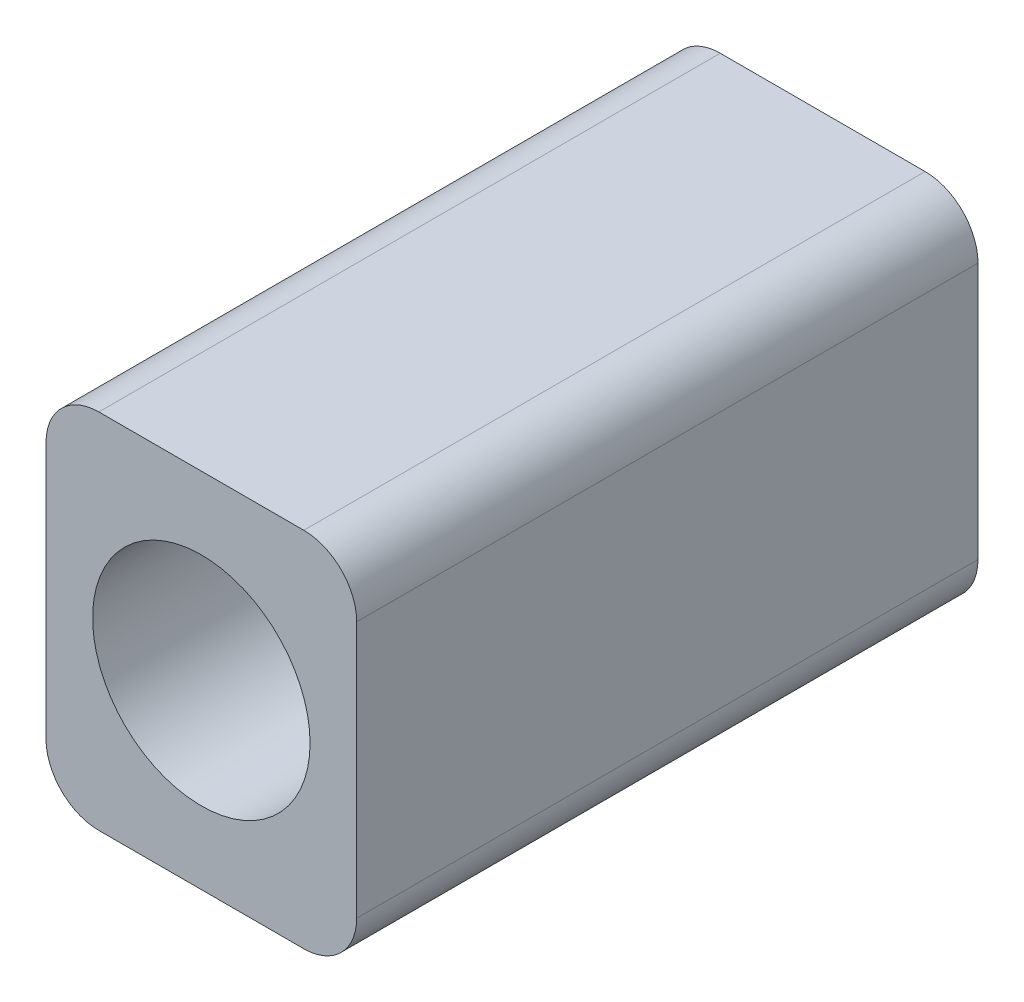
ISO-10303-21;
HEADER;
FILE_DESCRIPTION(('STEP AP214'),'2;1');
FILE_NAME('part.step','',(''),(''),'','','');
FILE_SCHEMA(('AUTOMOTIVE_DESIGN { 1 0 10303 214 1 1 1 1 }'));
ENDSEC;
DATA;
#1=APPLICATION_CONTEXT('core data for automotive mechanical design processes');
#2=APPLICATION_PROTOCOL_DEFINITION('international standard','automotive_design',2000,#1);
#3=PRODUCT_CONTEXT('',#1,'mechanical');
#4=PRODUCT('Part','Part','',(#3));
#5=PRODUCT_RELATED_PRODUCT_CATEGORY('part','',(#4));
#6=PRODUCT_DEFINITION_FORMATION('','',#4);
#7=PRODUCT_DEFINITION_CONTEXT('part definition',#1,'design');
#8=PRODUCT_DEFINITION('design','',#6,#7);
#9=PRODUCT_DEFINITION_SHAPE('','',#8);
#10=(LENGTH_UNIT() NAMED_UNIT(*) SI_UNIT(.MILLI.,.METRE.));
#11=(NAMED_UNIT(*) PLANE_ANGLE_UNIT() SI_UNIT($,.RADIAN.));
#12=(NAMED_UNIT(*) SI_UNIT($,.STERADIAN.) SOLID_ANGLE_UNIT());
#13=UNCERTAINTY_MEASURE_WITH_UNIT(LENGTH_MEASURE(1.E-05),#10,'distance_accuracy_value','');
#14=(GEOMETRIC_REPRESENTATION_CONTEXT(3) GLOBAL_UNCERTAINTY_ASSIGNED_CONTEXT((#13)) GLOBAL_UNIT_ASSIGNED_CONTEXT((#10,
#11,#12)) REPRESENTATION_CONTEXT('',''));
#15=CARTESIAN_POINT('',(0.,0.,0.));
#16=DIRECTION('',(0.,0.,1.));
#17=DIRECTION('',(1.,0.,0.));
#18=AXIS2_PLACEMENT_3D('',#15,#16,#17);
#19=CARTESIAN_POINT('',(1.02122729888413,1.02122729888413,12.));
#20=DIRECTION('',(0.,0.,-1.));
#21=DIRECTION('',(-1.,0.,0.));
#22=AXIS2_PLACEMENT_3D('',#19,#20,#21);
#23=CYLINDRICAL_SURFACE('',#22,1.02122729888413);
#24=CARTESIAN_POINT('',(1.02122729888413,1.02122729888413,0.));
#25=DIRECTION('',(0.,0.,1.));
#26=DIRECTION('',(-1.,0.,0.));
#27=AXIS2_PLACEMENT_3D('',#24,#25,#26);
#28=CIRCLE('',#27,1.02122729888413);
#29=CARTESIAN_POINT('',(0.,1.02122729888414,0.));
#30=VERTEX_POINT('',#29);
#31=CARTESIAN_POINT('',(1.02122729888414,0.,0.));
#32=VERTEX_POINT('',#31);
#33=EDGE_CURVE('E131',#30,#32,#28,.T.);
#34=ORIENTED_EDGE('',*,*,#33,.T.);
#35=DIRECTION('',(0.,0.,-1.));
#36=VECTOR('',#35,1.);
#37=CARTESIAN_POINT('',(1.02122729888414,0.,12.));
#38=LINE('',#37,#36);
#39=CARTESIAN_POINT('',(1.02122729888414,0.,12.));
#40=VERTEX_POINT('',#39);
#41=EDGE_CURVE('E11',#40,#32,#38,.T.);
#42=ORIENTED_EDGE('',*,*,#41,.F.);
#43=CARTESIAN_POINT('',(1.02122729888413,1.02122729888413,12.));
#44=DIRECTION('',(0.,0.,1.));
#45=DIRECTION('',(-1.,0.,0.));
#46=AXIS2_PLACEMENT_3D('',#43,#44,#45);
#47=CIRCLE('',#46,1.02122729888413);
#48=CARTESIAN_POINT('',(0.,1.02122729888414,12.));
#49=VERTEX_POINT('',#48);
#50=EDGE_CURVE('E146',#49,#40,#47,.T.);
#51=ORIENTED_EDGE('',*,*,#50,.F.);
#52=DIRECTION('',(0.,0.,-1.));
#53=VECTOR('',#52,1.);
#54=CARTESIAN_POINT('',(0.,1.02122729888414,12.));
#55=LINE('',#54,#53);
#56=EDGE_CURVE('E127',#49,#30,#55,.T.);
#57=ORIENTED_EDGE('',*,*,#56,.T.);
#58=EDGE_LOOP('',(#34,#42,#51,#57));
#59=FACE_BOUND('',#58,.T.);
#60=ADVANCED_FACE('F35',(#59),#23,.T.);
#61=CARTESIAN_POINT('',(1.02122729888414,0.,12.));
#62=DIRECTION('',(0.,1.,0.));
#63=DIRECTION('',(0.,0.,1.));
#64=AXIS2_PLACEMENT_3D('',#61,#62,#63);
#65=PLANE('',#64);
#66=DIRECTION('',(1.,0.,0.));
#67=VECTOR('',#66,1.);
#68=CARTESIAN_POINT('',(1.02122729888414,0.,0.));
#69=LINE('',#68,#67);
#70=CARTESIAN_POINT('',(4.97877270111587,0.,0.));
#71=VERTEX_POINT('',#70);
#72=EDGE_CURVE('E134',#32,#71,#69,.T.);
#73=ORIENTED_EDGE('',*,*,#72,.T.);
#74=DIRECTION('',(0.,0.,-1.));
#75=VECTOR('',#74,1.);
#76=CARTESIAN_POINT('',(4.97877270111587,0.,12.));
#77=LINE('',#76,#75);
#78=CARTESIAN_POINT('',(4.97877270111587,0.,12.));
#79=VERTEX_POINT('',#78);
#80=EDGE_CURVE('E43',#79,#71,#77,.T.);
#81=ORIENTED_EDGE('',*,*,#80,.F.);
#82=DIRECTION('',(1.,0.,0.));
#83=VECTOR('',#82,1.);
#84=CARTESIAN_POINT('',(1.02122729888414,0.,12.));
#85=LINE('',#84,#83);
#86=EDGE_CURVE('E94',#40,#79,#85,.T.);
#87=ORIENTED_EDGE('',*,*,#86,.F.);
#88=ORIENTED_EDGE('',*,*,#41,.T.);
#89=EDGE_LOOP('',(#73,#81,#87,#88));
#90=FACE_BOUND('',#89,.T.);
#91=ADVANCED_FACE('F203',(#90),#65,.F.);
#92=CARTESIAN_POINT('',(4.97877270111587,1.02122729888413,12.));
#93=DIRECTION('',(0.,0.,-1.));
#94=DIRECTION('',(-1.,0.,0.));
#95=AXIS2_PLACEMENT_3D('',#92,#93,#94);
#96=CYLINDRICAL_SURFACE('',#95,1.02122729888413);
#97=CARTESIAN_POINT('',(4.97877270111587,1.02122729888413,0.));
#98=DIRECTION('',(0.,0.,1.));
#99=DIRECTION('',(-1.,0.,0.));
#100=AXIS2_PLACEMENT_3D('',#97,#98,#99);
#101=CIRCLE('',#100,1.02122729888413);
#102=CARTESIAN_POINT('',(6.,1.02122729888413,0.));
#103=VERTEX_POINT('',#102);
#104=EDGE_CURVE('E137',#71,#103,#101,.T.);
#105=ORIENTED_EDGE('',*,*,#104,.T.);
#106=DIRECTION('',(0.,0.,-1.));
#107=VECTOR('',#106,1.);
#108=CARTESIAN_POINT('',(6.,1.02122729888413,12.));
#109=LINE('',#108,#107);
#110=CARTESIAN_POINT('',(6.,1.02122729888413,12.));
#111=VERTEX_POINT('',#110);
#112=EDGE_CURVE('E153',#111,#103,#109,.T.);
#113=ORIENTED_EDGE('',*,*,#112,.F.);
#114=CARTESIAN_POINT('',(4.97877270111587,1.02122729888413,12.));
#115=DIRECTION('',(0.,0.,1.));
#116=DIRECTION('',(-1.,0.,0.));
#117=AXIS2_PLACEMENT_3D('',#114,#115,#116);
#118=CIRCLE('',#117,1.02122729888413);
#119=EDGE_CURVE('E161',#79,#111,#118,.T.);
#120=ORIENTED_EDGE('',*,*,#119,.F.);
#121=ORIENTED_EDGE('',*,*,#80,.T.);
#122=EDGE_LOOP('',(#105,#113,#120,#121));
#123=FACE_BOUND('',#122,.T.);
#124=ADVANCED_FACE('F159',(#123),#96,.T.);
#125=CARTESIAN_POINT('',(6.,1.02122729888413,12.));
#126=DIRECTION('',(-1.,0.,0.));
#127=DIRECTION('',(0.,0.,1.));
#128=AXIS2_PLACEMENT_3D('',#125,#126,#127);
#129=PLANE('',#128);
#130=DIRECTION('',(0.,1.,0.));
#131=VECTOR('',#130,1.);
#132=CARTESIAN_POINT('',(6.,1.02122729888413,0.));
#133=LINE('',#132,#131);
#134=CARTESIAN_POINT('',(6.,5.97877270111587,0.));
#135=VERTEX_POINT('',#134);
#136=EDGE_CURVE('E139',#103,#135,#133,.T.);
#137=ORIENTED_EDGE('',*,*,#136,.T.);
#138=DIRECTION('',(0.,0.,-1.));
#139=VECTOR('',#138,1.);
#140=CARTESIAN_POINT('',(6.,5.97877270111587,12.));
#141=LINE('',#140,#139);
#142=CARTESIAN_POINT('',(6.,5.97877270111587,12.));
#143=VERTEX_POINT('',#142);
#144=EDGE_CURVE('E150',#143,#135,#141,.T.);
#145=ORIENTED_EDGE('',*,*,#144,.F.);
#146=DIRECTION('',(0.,1.,0.));
#147=VECTOR('',#146,1.);
#148=CARTESIAN_POINT('',(6.,1.02122729888413,12.));
#149=LINE('',#148,#147);
#150=EDGE_CURVE('E173',#111,#143,#149,.T.);
#151=ORIENTED_EDGE('',*,*,#150,.F.);
#152=ORIENTED_EDGE('',*,*,#112,.T.);
#153=EDGE_LOOP('',(#137,#145,#151,#152));
#154=FACE_BOUND('',#153,.T.);
#155=ADVANCED_FACE('F169',(#154),#129,.F.);
#156=CARTESIAN_POINT('',(4.97877270111587,5.97877270111587,12.));
#157=DIRECTION('',(0.,0.,-1.));
#158=DIRECTION('',(-1.,0.,0.));
#159=AXIS2_PLACEMENT_3D('',#156,#157,#158);
#160=CYLINDRICAL_SURFACE('',#159,1.02122729888413);
#161=CARTESIAN_POINT('',(4.97877270111587,5.97877270111587,0.));
#162=DIRECTION('',(0.,0.,1.));
#163=DIRECTION('',(1.,0.,0.));
#164=AXIS2_PLACEMENT_3D('',#161,#162,#163);
#165=CIRCLE('',#164,1.02122729888413);
#166=CARTESIAN_POINT('',(4.97877270111587,7.,0.));
#167=VERTEX_POINT('',#166);
#168=EDGE_CURVE('E141',#135,#167,#165,.T.);
#169=ORIENTED_EDGE('',*,*,#168,.T.);
#170=DIRECTION('',(0.,0.,-1.));
#171=VECTOR('',#170,1.);
#172=CARTESIAN_POINT('',(4.97877270111587,7.,12.));
#173=LINE('',#172,#171);
#174=CARTESIAN_POINT('',(4.97877270111587,7.,12.));
#175=VERTEX_POINT('',#174);
#176=EDGE_CURVE('E122',#175,#167,#173,.T.);
#177=ORIENTED_EDGE('',*,*,#176,.F.);
#178=CARTESIAN_POINT('',(4.97877270111587,5.97877270111587,12.));
#179=DIRECTION('',(0.,0.,1.));
#180=DIRECTION('',(1.,0.,0.));
#181=AXIS2_PLACEMENT_3D('',#178,#179,#180);
#182=CIRCLE('',#181,1.02122729888413);
#183=EDGE_CURVE('E113',#143,#175,#182,.T.);
#184=ORIENTED_EDGE('',*,*,#183,.F.);
#185=ORIENTED_EDGE('',*,*,#144,.T.);
#186=EDGE_LOOP('',(#169,#177,#184,#185));
#187=FACE_BOUND('',#186,.T.);
#188=ADVANCED_FACE('F172',(#187),#160,.T.);
#189=CARTESIAN_POINT('',(1.02122729888414,7.,12.));
#190=DIRECTION('',(0.,-1.,0.));
#191=DIRECTION('',(0.,0.,-1.));
#192=AXIS2_PLACEMENT_3D('',#189,#190,#191);
#193=PLANE('',#192);
#194=DIRECTION('',(-1.,0.,0.));
#195=VECTOR('',#194,1.);
#196=CARTESIAN_POINT('',(1.02122729888414,7.,0.));
#197=LINE('',#196,#195);
#198=CARTESIAN_POINT('',(1.02122729888414,7.,0.));
#199=VERTEX_POINT('',#198);
#200=EDGE_CURVE('E121',#167,#199,#197,.T.);
#201=ORIENTED_EDGE('',*,*,#200,.T.);
#202=DIRECTION('',(0.,0.,-1.));
#203=VECTOR('',#202,1.);
#204=CARTESIAN_POINT('',(1.02122729888414,7.,12.));
#205=LINE('',#204,#203);
#206=CARTESIAN_POINT('',(1.02122729888414,7.,12.));
#207=VERTEX_POINT('',#206);
#208=EDGE_CURVE('E118',#207,#199,#205,.T.);
#209=ORIENTED_EDGE('',*,*,#208,.F.);
#210=DIRECTION('',(-1.,0.,0.));
#211=VECTOR('',#210,1.);
#212=CARTESIAN_POINT('',(1.02122729888414,7.,12.));
#213=LINE('',#212,#211);
#214=EDGE_CURVE('E107',#175,#207,#213,.T.);
#215=ORIENTED_EDGE('',*,*,#214,.F.);
#216=ORIENTED_EDGE('',*,*,#176,.T.);
#217=EDGE_LOOP('',(#201,#209,#215,#216));
#218=FACE_BOUND('',#217,.T.);
#219=ADVANCED_FACE('F119',(#218),#193,.F.);
#220=CARTESIAN_POINT('',(1.02122729888413,5.97877270111587,12.));
#221=DIRECTION('',(0.,0.,-1.));
#222=DIRECTION('',(-1.,0.,0.));
#223=AXIS2_PLACEMENT_3D('',#220,#221,#222);
#224=CYLINDRICAL_SURFACE('',#223,1.02122729888413);
#225=CARTESIAN_POINT('',(1.02122729888413,5.97877270111587,0.));
#226=DIRECTION('',(0.,0.,1.));
#227=DIRECTION('',(-1.,0.,0.));
#228=AXIS2_PLACEMENT_3D('',#225,#226,#227);
#229=CIRCLE('',#228,1.02122729888413);
#230=CARTESIAN_POINT('',(0.,5.97877270111586,0.));
#231=VERTEX_POINT('',#230);
#232=EDGE_CURVE('E80',#199,#231,#229,.T.);
#233=ORIENTED_EDGE('',*,*,#232,.T.);
#234=DIRECTION('',(0.,0.,-1.));
#235=VECTOR('',#234,1.);
#236=CARTESIAN_POINT('',(0.,5.97877270111586,12.));
#237=LINE('',#236,#235);
#238=CARTESIAN_POINT('',(0.,5.97877270111586,12.));
#239=VERTEX_POINT('',#238);
#240=EDGE_CURVE('E123',#239,#231,#237,.T.);
#241=ORIENTED_EDGE('',*,*,#240,.F.);
#242=CARTESIAN_POINT('',(1.02122729888413,5.97877270111587,12.));
#243=DIRECTION('',(0.,0.,1.));
#244=DIRECTION('',(-1.,0.,0.));
#245=AXIS2_PLACEMENT_3D('',#242,#243,#244);
#246=CIRCLE('',#245,1.02122729888413);
#247=EDGE_CURVE('E111',#207,#239,#246,.T.);
#248=ORIENTED_EDGE('',*,*,#247,.F.);
#249=ORIENTED_EDGE('',*,*,#208,.T.);
#250=EDGE_LOOP('',(#233,#241,#248,#249));
#251=FACE_BOUND('',#250,.T.);
#252=ADVANCED_FACE('F125',(#251),#224,.T.);
#253=CARTESIAN_POINT('',(0.,1.02122729888414,12.));
#254=DIRECTION('',(1.,0.,0.));
#255=DIRECTION('',(0.,0.,-1.));
#256=AXIS2_PLACEMENT_3D('',#253,#254,#255);
#257=PLANE('',#256);
#258=DIRECTION('',(0.,-1.,0.));
#259=VECTOR('',#258,1.);
#260=CARTESIAN_POINT('',(0.,1.02122729888414,0.));
#261=LINE('',#260,#259);
#262=EDGE_CURVE('E86',#231,#30,#261,.T.);
#263=ORIENTED_EDGE('',*,*,#262,.T.);
#264=ORIENTED_EDGE('',*,*,#56,.F.);
#265=DIRECTION('',(0.,-1.,0.));
#266=VECTOR('',#265,1.);
#267=CARTESIAN_POINT('',(0.,1.02122729888414,12.));
#268=LINE('',#267,#266);
#269=EDGE_CURVE('E51',#239,#49,#268,.T.);
#270=ORIENTED_EDGE('',*,*,#269,.F.);
#271=ORIENTED_EDGE('',*,*,#240,.T.);
#272=EDGE_LOOP('',(#263,#264,#270,#271));
#273=FACE_BOUND('',#272,.T.);
#274=ADVANCED_FACE('F194',(#273),#257,.F.);
#275=CARTESIAN_POINT('',(1.02122729888413,1.02122729888413,12.));
#276=DIRECTION('',(0.,0.,-1.));
#277=DIRECTION('',(-1.,0.,0.));
#278=AXIS2_PLACEMENT_3D('',#275,#276,#277);
#279=PLANE('',#278);
#280=CARTESIAN_POINT('',(3.,3.5,12.));
#281=DIRECTION('',(0.,0.,1.));
#282=DIRECTION('',(1.,0.,0.));
#283=AXIS2_PLACEMENT_3D('',#280,#281,#282);
#284=CIRCLE('',#283,2.1);
#285=CARTESIAN_POINT('',(5.1,3.5,12.));
#286=VERTEX_POINT('',#285);
#287=EDGE_CURVE('E179',#286,#286,#284,.T.);
#288=ORIENTED_EDGE('',*,*,#287,.F.);
#289=EDGE_LOOP('',(#288));
#290=FACE_BOUND('',#289,.T.);
#291=ORIENTED_EDGE('',*,*,#50,.T.);
#292=ORIENTED_EDGE('',*,*,#86,.T.);
#293=ORIENTED_EDGE('',*,*,#119,.T.);
#294=ORIENTED_EDGE('',*,*,#150,.T.);
#295=ORIENTED_EDGE('',*,*,#183,.T.);
#296=ORIENTED_EDGE('',*,*,#214,.T.);
#297=ORIENTED_EDGE('',*,*,#247,.T.);
#298=ORIENTED_EDGE('',*,*,#269,.T.);
#299=EDGE_LOOP('',(#291,#292,#293,#294,#295,#296,#297,#298));
#300=FACE_BOUND('',#299,.T.);
#301=ADVANCED_FACE('F109',(#290,#300),#279,.F.);
#302=CARTESIAN_POINT('',(1.02122729888413,1.02122729888413,0.));
#303=DIRECTION('',(0.,0.,-1.));
#304=DIRECTION('',(-1.,0.,0.));
#305=AXIS2_PLACEMENT_3D('',#302,#303,#304);
#306=PLANE('',#305);
#307=ORIENTED_EDGE('',*,*,#33,.F.);
#308=ORIENTED_EDGE('',*,*,#262,.F.);
#309=ORIENTED_EDGE('',*,*,#232,.F.);
#310=ORIENTED_EDGE('',*,*,#200,.F.);
#311=ORIENTED_EDGE('',*,*,#168,.F.);
#312=ORIENTED_EDGE('',*,*,#136,.F.);
#313=ORIENTED_EDGE('',*,*,#104,.F.);
#314=ORIENTED_EDGE('',*,*,#72,.F.);
#315=EDGE_LOOP('',(#307,#308,#309,#310,#311,#312,#313,#314));
#316=FACE_BOUND('',#315,.T.);
#317=ADVANCED_FACE('F165',(#316),#306,.T.);
#318=CARTESIAN_POINT('',(3.,3.5,4.));
#319=DIRECTION('',(0.,0.,1.));
#320=DIRECTION('',(1.,0.,0.));
#321=AXIS2_PLACEMENT_3D('',#318,#319,#320);
#322=CYLINDRICAL_SURFACE('',#321,2.1);
#323=CARTESIAN_POINT('',(3.,3.5,4.));
#324=DIRECTION('',(0.,0.,1.));
#325=DIRECTION('',(1.,0.,0.));
#326=AXIS2_PLACEMENT_3D('',#323,#324,#325);
#327=CIRCLE('',#326,2.1);
#328=CARTESIAN_POINT('',(5.1,3.5,4.));
#329=VERTEX_POINT('',#328);
#330=EDGE_CURVE('E135',#329,#329,#327,.T.);
#331=ORIENTED_EDGE('',*,*,#330,.F.);
#332=EDGE_LOOP('',(#331));
#333=FACE_BOUND('',#332,.T.);
#334=ORIENTED_EDGE('',*,*,#287,.T.);
#335=EDGE_LOOP('',(#334));
#336=FACE_BOUND('',#335,.T.);
#337=ADVANCED_FACE('F187',(#333,#336),#322,.F.);
#338=CARTESIAN_POINT('',(3.,3.5,4.));
#339=DIRECTION('',(0.,0.,1.));
#340=DIRECTION('',(1.,0.,0.));
#341=AXIS2_PLACEMENT_3D('',#338,#339,#340);
#342=PLANE('',#341);
#343=ORIENTED_EDGE('',*,*,#330,.T.);
#344=EDGE_LOOP('',(#343));
#345=FACE_BOUND('',#344,.T.);
#346=ADVANCED_FACE('F185',(#345),#342,.T.);
#347=CLOSED_SHELL('',(#60,#91,#124,#155,#188,#219,#252,#274,#301,#317,#337,#346));
#348=MANIFOLD_SOLID_BREP('B2',#347);
#349=ADVANCED_BREP_SHAPE_REPRESENTATION('',(#18,#348),#14);
#350=SHAPE_DEFINITION_REPRESENTATION(#9,#349);
ENDSEC;
END-ISO-10303-21;
